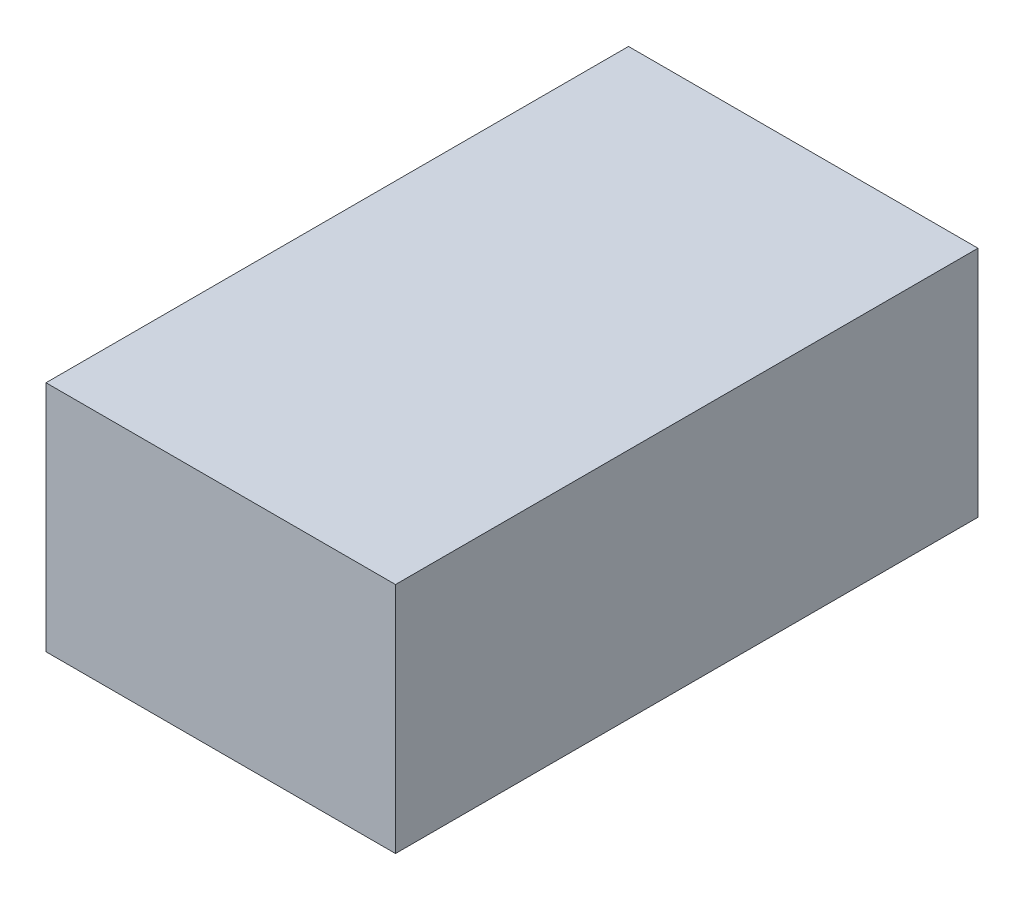
ISO-10303-21;
HEADER;
FILE_DESCRIPTION(('STEP AP214'),'2;1');
FILE_NAME('part.step','',(''),(''),'','','');
FILE_SCHEMA(('AUTOMOTIVE_DESIGN { 1 0 10303 214 1 1 1 1 }'));
ENDSEC;
DATA;
#1=APPLICATION_CONTEXT('core data for automotive mechanical design processes');
#2=APPLICATION_PROTOCOL_DEFINITION('international standard','automotive_design',2000,#1);
#3=PRODUCT_CONTEXT('',#1,'mechanical');
#4=PRODUCT('Part','Part','',(#3));
#5=PRODUCT_RELATED_PRODUCT_CATEGORY('part','',(#4));
#6=PRODUCT_DEFINITION_FORMATION('','',#4);
#7=PRODUCT_DEFINITION_CONTEXT('part definition',#1,'design');
#8=PRODUCT_DEFINITION('design','',#6,#7);
#9=PRODUCT_DEFINITION_SHAPE('','',#8);
#10=(LENGTH_UNIT() NAMED_UNIT(*) SI_UNIT(.MILLI.,.METRE.));
#11=(NAMED_UNIT(*) PLANE_ANGLE_UNIT() SI_UNIT($,.RADIAN.));
#12=(NAMED_UNIT(*) SI_UNIT($,.STERADIAN.) SOLID_ANGLE_UNIT());
#13=UNCERTAINTY_MEASURE_WITH_UNIT(LENGTH_MEASURE(1.E-05),#10,'distance_accuracy_value','');
#14=(GEOMETRIC_REPRESENTATION_CONTEXT(3) GLOBAL_UNCERTAINTY_ASSIGNED_CONTEXT((#13)) GLOBAL_UNIT_ASSIGNED_CONTEXT((#10,
#11,#12)) REPRESENTATION_CONTEXT('',''));
#15=CARTESIAN_POINT('',(0.,0.,0.));
#16=DIRECTION('',(0.,0.,1.));
#17=DIRECTION('',(1.,0.,0.));
#18=AXIS2_PLACEMENT_3D('',#15,#16,#17);
#19=CARTESIAN_POINT('',(60.,-20.,-50.));
#20=DIRECTION('',(0.,0.,1.));
#21=DIRECTION('',(1.,0.,0.));
#22=AXIS2_PLACEMENT_3D('',#19,#20,#21);
#23=PLANE('',#22);
#24=DIRECTION('',(0.,1.,0.));
#25=VECTOR('',#24,1.);
#26=CARTESIAN_POINT('',(0.,-20.,-50.));
#27=LINE('',#26,#25);
#28=CARTESIAN_POINT('',(0.,-20.,-50.));
#29=VERTEX_POINT('',#28);
#30=CARTESIAN_POINT('',(0.,20.,-50.));
#31=VERTEX_POINT('',#30);
#32=EDGE_CURVE('E111',#29,#31,#27,.T.);
#33=ORIENTED_EDGE('',*,*,#32,.T.);
#34=DIRECTION('',(-1.,0.,0.));
#35=VECTOR('',#34,1.);
#36=CARTESIAN_POINT('',(60.,20.,-50.));
#37=LINE('',#36,#35);
#38=CARTESIAN_POINT('',(60.,20.,-50.));
#39=VERTEX_POINT('',#38);
#40=EDGE_CURVE('E11',#39,#31,#37,.T.);
#41=ORIENTED_EDGE('',*,*,#40,.F.);
#42=DIRECTION('',(0.,1.,0.));
#43=VECTOR('',#42,1.);
#44=CARTESIAN_POINT('',(60.,-20.,-50.));
#45=LINE('',#44,#43);
#46=CARTESIAN_POINT('',(60.,-20.,-50.));
#47=VERTEX_POINT('',#46);
#48=EDGE_CURVE('E95',#47,#39,#45,.T.);
#49=ORIENTED_EDGE('',*,*,#48,.F.);
#50=DIRECTION('',(-1.,0.,0.));
#51=VECTOR('',#50,1.);
#52=CARTESIAN_POINT('',(60.,-20.,-50.));
#53=LINE('',#52,#51);
#54=EDGE_CURVE('E107',#47,#29,#53,.T.);
#55=ORIENTED_EDGE('',*,*,#54,.T.);
#56=EDGE_LOOP('',(#33,#41,#49,#55));
#57=FACE_BOUND('',#56,.T.);
#58=ADVANCED_FACE('F43',(#57),#23,.F.);
#59=CARTESIAN_POINT('',(60.,20.,50.));
#60=DIRECTION('',(0.,-1.,0.));
#61=DIRECTION('',(0.,0.,-1.));
#62=AXIS2_PLACEMENT_3D('',#59,#60,#61);
#63=PLANE('',#62);
#64=DIRECTION('',(0.,0.,1.));
#65=VECTOR('',#64,1.);
#66=CARTESIAN_POINT('',(0.,20.,50.));
#67=LINE('',#66,#65);
#68=CARTESIAN_POINT('',(0.,20.,50.));
#69=VERTEX_POINT('',#68);
#70=EDGE_CURVE('E100',#31,#69,#67,.T.);
#71=ORIENTED_EDGE('',*,*,#70,.T.);
#72=DIRECTION('',(-1.,0.,0.));
#73=VECTOR('',#72,1.);
#74=CARTESIAN_POINT('',(60.,20.,50.));
#75=LINE('',#74,#73);
#76=CARTESIAN_POINT('',(60.,20.,50.));
#77=VERTEX_POINT('',#76);
#78=EDGE_CURVE('E52',#77,#69,#75,.T.);
#79=ORIENTED_EDGE('',*,*,#78,.F.);
#80=DIRECTION('',(0.,0.,1.));
#81=VECTOR('',#80,1.);
#82=CARTESIAN_POINT('',(60.,20.,50.));
#83=LINE('',#82,#81);
#84=EDGE_CURVE('E90',#39,#77,#83,.T.);
#85=ORIENTED_EDGE('',*,*,#84,.F.);
#86=ORIENTED_EDGE('',*,*,#40,.T.);
#87=EDGE_LOOP('',(#71,#79,#85,#86));
#88=FACE_BOUND('',#87,.T.);
#89=ADVANCED_FACE('F99',(#88),#63,.F.);
#90=CARTESIAN_POINT('',(60.,-20.,50.));
#91=DIRECTION('',(0.,0.,-1.));
#92=DIRECTION('',(-1.,0.,0.));
#93=AXIS2_PLACEMENT_3D('',#90,#91,#92);
#94=PLANE('',#93);
#95=DIRECTION('',(0.,-1.,0.));
#96=VECTOR('',#95,1.);
#97=CARTESIAN_POINT('',(0.,-20.,50.));
#98=LINE('',#97,#96);
#99=CARTESIAN_POINT('',(0.,-20.,50.));
#100=VERTEX_POINT('',#99);
#101=EDGE_CURVE('E77',#69,#100,#98,.T.);
#102=ORIENTED_EDGE('',*,*,#101,.T.);
#103=DIRECTION('',(-1.,0.,0.));
#104=VECTOR('',#103,1.);
#105=CARTESIAN_POINT('',(60.,-20.,50.));
#106=LINE('',#105,#104);
#107=CARTESIAN_POINT('',(60.,-20.,50.));
#108=VERTEX_POINT('',#107);
#109=EDGE_CURVE('E102',#108,#100,#106,.T.);
#110=ORIENTED_EDGE('',*,*,#109,.F.);
#111=DIRECTION('',(0.,-1.,0.));
#112=VECTOR('',#111,1.);
#113=CARTESIAN_POINT('',(60.,-20.,50.));
#114=LINE('',#113,#112);
#115=EDGE_CURVE('E93',#77,#108,#114,.T.);
#116=ORIENTED_EDGE('',*,*,#115,.F.);
#117=ORIENTED_EDGE('',*,*,#78,.T.);
#118=EDGE_LOOP('',(#102,#110,#116,#117));
#119=FACE_BOUND('',#118,.T.);
#120=ADVANCED_FACE('F103',(#119),#94,.F.);
#121=CARTESIAN_POINT('',(60.,-20.,50.));
#122=DIRECTION('',(0.,1.,0.));
#123=DIRECTION('',(0.,0.,1.));
#124=AXIS2_PLACEMENT_3D('',#121,#122,#123);
#125=PLANE('',#124);
#126=DIRECTION('',(0.,0.,-1.));
#127=VECTOR('',#126,1.);
#128=CARTESIAN_POINT('',(0.,-20.,50.));
#129=LINE('',#128,#127);
#130=EDGE_CURVE('E83',#100,#29,#129,.T.);
#131=ORIENTED_EDGE('',*,*,#130,.T.);
#132=ORIENTED_EDGE('',*,*,#54,.F.);
#133=DIRECTION('',(0.,0.,-1.));
#134=VECTOR('',#133,1.);
#135=CARTESIAN_POINT('',(60.,-20.,50.));
#136=LINE('',#135,#134);
#137=EDGE_CURVE('E60',#108,#47,#136,.T.);
#138=ORIENTED_EDGE('',*,*,#137,.F.);
#139=ORIENTED_EDGE('',*,*,#109,.T.);
#140=EDGE_LOOP('',(#131,#132,#138,#139));
#141=FACE_BOUND('',#140,.T.);
#142=ADVANCED_FACE('F124',(#141),#125,.F.);
#143=CARTESIAN_POINT('',(60.,0.,0.));
#144=DIRECTION('',(-1.,0.,0.));
#145=DIRECTION('',(0.,0.,1.));
#146=AXIS2_PLACEMENT_3D('',#143,#144,#145);
#147=PLANE('',#146);
#148=ORIENTED_EDGE('',*,*,#48,.T.);
#149=ORIENTED_EDGE('',*,*,#84,.T.);
#150=ORIENTED_EDGE('',*,*,#115,.T.);
#151=ORIENTED_EDGE('',*,*,#137,.T.);
#152=EDGE_LOOP('',(#148,#149,#150,#151));
#153=FACE_BOUND('',#152,.T.);
#154=ADVANCED_FACE('F91',(#153),#147,.F.);
#155=CARTESIAN_POINT('',(0.,0.,0.));
#156=DIRECTION('',(-1.,0.,0.));
#157=DIRECTION('',(0.,0.,1.));
#158=AXIS2_PLACEMENT_3D('',#155,#156,#157);
#159=PLANE('',#158);
#160=ORIENTED_EDGE('',*,*,#32,.F.);
#161=ORIENTED_EDGE('',*,*,#130,.F.);
#162=ORIENTED_EDGE('',*,*,#101,.F.);
#163=ORIENTED_EDGE('',*,*,#70,.F.);
#164=EDGE_LOOP('',(#160,#161,#162,#163));
#165=FACE_BOUND('',#164,.T.);
#166=ADVANCED_FACE('F127',(#165),#159,.T.);
#167=CLOSED_SHELL('',(#58,#89,#120,#142,#154,#166));
#168=MANIFOLD_SOLID_BREP('B2',#167);
#169=ADVANCED_BREP_SHAPE_REPRESENTATION('',(#18,#168),#14);
#170=SHAPE_DEFINITION_REPRESENTATION(#9,#169);
ENDSEC;
END-ISO-10303-21;
